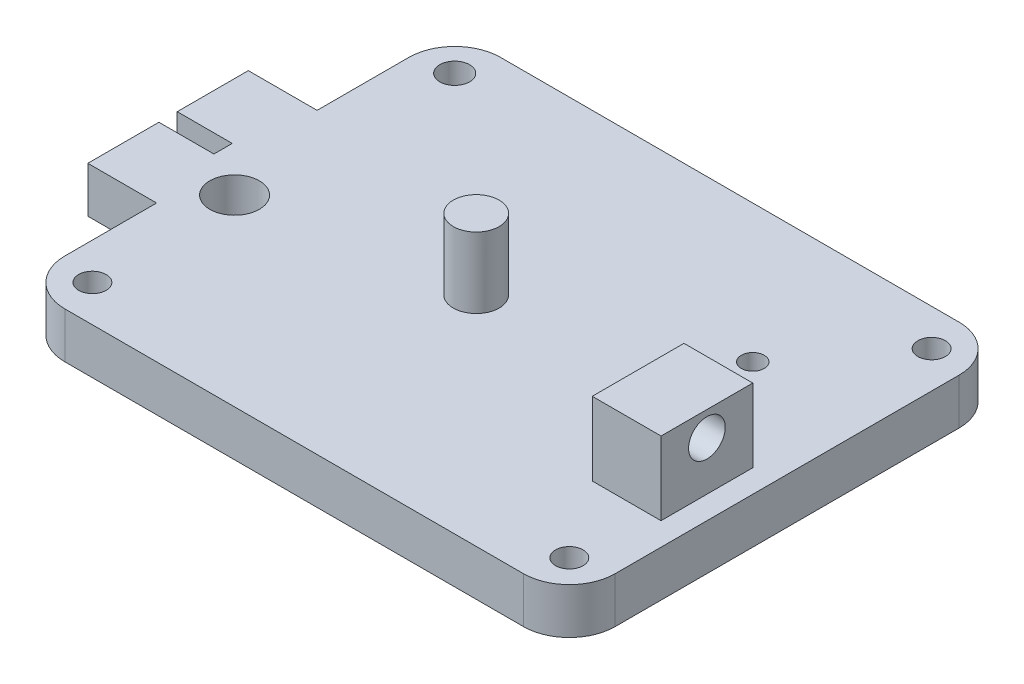
ISO-10303-21;
HEADER;
FILE_DESCRIPTION(('STEP AP214'),'2;1');
FILE_NAME('part.step','',(''),(''),'','','');
FILE_SCHEMA(('AUTOMOTIVE_DESIGN { 1 0 10303 214 1 1 1 1 }'));
ENDSEC;
DATA;
#1=APPLICATION_CONTEXT('core data for automotive mechanical design processes');
#2=APPLICATION_PROTOCOL_DEFINITION('international standard','automotive_design',2000,#1);
#3=PRODUCT_CONTEXT('',#1,'mechanical');
#4=PRODUCT('Part','Part','',(#3));
#5=PRODUCT_RELATED_PRODUCT_CATEGORY('part','',(#4));
#6=PRODUCT_DEFINITION_FORMATION('','',#4);
#7=PRODUCT_DEFINITION_CONTEXT('part definition',#1,'design');
#8=PRODUCT_DEFINITION('design','',#6,#7);
#9=PRODUCT_DEFINITION_SHAPE('','',#8);
#10=(LENGTH_UNIT() NAMED_UNIT(*) SI_UNIT(.MILLI.,.METRE.));
#11=(NAMED_UNIT(*) PLANE_ANGLE_UNIT() SI_UNIT($,.RADIAN.));
#12=(NAMED_UNIT(*) SI_UNIT($,.STERADIAN.) SOLID_ANGLE_UNIT());
#13=UNCERTAINTY_MEASURE_WITH_UNIT(LENGTH_MEASURE(1.E-05),#10,'distance_accuracy_value','');
#14=(GEOMETRIC_REPRESENTATION_CONTEXT(3) GLOBAL_UNCERTAINTY_ASSIGNED_CONTEXT((#13)) GLOBAL_UNIT_ASSIGNED_CONTEXT((#10,
#11,#12)) REPRESENTATION_CONTEXT('',''));
#15=CARTESIAN_POINT('',(0.,0.,0.));
#16=DIRECTION('',(0.,0.,1.));
#17=DIRECTION('',(1.,0.,0.));
#18=AXIS2_PLACEMENT_3D('',#15,#16,#17);
#19=CARTESIAN_POINT('',(-15.,0.,0.));
#20=DIRECTION('',(-1.,0.,0.));
#21=DIRECTION('',(0.,0.,1.));
#22=AXIS2_PLACEMENT_3D('',#19,#20,#21);
#23=PLANE('',#22);
#24=DIRECTION('',(0.,1.,0.));
#25=VECTOR('',#24,1.);
#26=CARTESIAN_POINT('',(-15.,0.,-45.5));
#27=LINE('',#26,#25);
#28=CARTESIAN_POINT('',(-15.,0.,-45.5));
#29=VERTEX_POINT('',#28);
#30=CARTESIAN_POINT('',(-15.,10.,-45.5));
#31=VERTEX_POINT('',#30);
#32=EDGE_CURVE('E222',#29,#31,#27,.T.);
#33=ORIENTED_EDGE('',*,*,#32,.F.);
#34=DIRECTION('',(0.,0.,1.));
#35=VECTOR('',#34,1.);
#36=CARTESIAN_POINT('',(-15.,0.,-65.));
#37=LINE('',#36,#35);
#38=CARTESIAN_POINT('',(-15.,0.,-30.));
#39=VERTEX_POINT('',#38);
#40=EDGE_CURVE('E231',#29,#39,#37,.T.);
#41=ORIENTED_EDGE('',*,*,#40,.T.);
#42=DIRECTION('',(0.,1.,0.));
#43=VECTOR('',#42,1.);
#44=CARTESIAN_POINT('',(-15.,10.,-30.));
#45=LINE('',#44,#43);
#46=CARTESIAN_POINT('',(-15.,10.,-30.));
#47=VERTEX_POINT('',#46);
#48=EDGE_CURVE('E236',#39,#47,#45,.T.);
#49=ORIENTED_EDGE('',*,*,#48,.T.);
#50=DIRECTION('',(0.,0.,-1.));
#51=VECTOR('',#50,1.);
#52=CARTESIAN_POINT('',(-15.,10.,-65.));
#53=LINE('',#52,#51);
#54=EDGE_CURVE('E240',#47,#31,#53,.T.);
#55=ORIENTED_EDGE('',*,*,#54,.T.);
#56=EDGE_LOOP('',(#33,#41,#49,#55));
#57=FACE_BOUND('',#56,.T.);
#58=ADVANCED_FACE('F41',(#57),#23,.T.);
#59=CARTESIAN_POINT('',(0.,10.,0.));
#60=DIRECTION('',(1.,0.,0.));
#61=DIRECTION('',(0.,0.,-1.));
#62=AXIS2_PLACEMENT_3D('',#59,#60,#61);
#63=PLANE('',#62);
#64=DIRECTION('',(0.,-1.,0.));
#65=VECTOR('',#64,1.);
#66=CARTESIAN_POINT('',(0.,10.,-65.));
#67=LINE('',#66,#65);
#68=CARTESIAN_POINT('',(0.,10.,-65.));
#69=VERTEX_POINT('',#68);
#70=CARTESIAN_POINT('',(0.,0.,-65.));
#71=VERTEX_POINT('',#70);
#72=EDGE_CURVE('E221',#69,#71,#67,.T.);
#73=ORIENTED_EDGE('',*,*,#72,.F.);
#74=DIRECTION('',(0.,0.,1.));
#75=VECTOR('',#74,1.);
#76=CARTESIAN_POINT('',(0.,10.,0.));
#77=LINE('',#76,#75);
#78=CARTESIAN_POINT('',(0.,10.,-85.));
#79=VERTEX_POINT('',#78);
#80=EDGE_CURVE('E315',#79,#69,#77,.T.);
#81=ORIENTED_EDGE('',*,*,#80,.F.);
#82=DIRECTION('',(0.,-1.,0.));
#83=VECTOR('',#82,1.);
#84=CARTESIAN_POINT('',(0.,10.,-85.));
#85=LINE('',#84,#83);
#86=CARTESIAN_POINT('',(0.,0.,-85.));
#87=VERTEX_POINT('',#86);
#88=EDGE_CURVE('E366',#79,#87,#85,.T.);
#89=ORIENTED_EDGE('',*,*,#88,.T.);
#90=DIRECTION('',(0.,0.,1.));
#91=VECTOR('',#90,1.);
#92=CARTESIAN_POINT('',(0.,0.,0.));
#93=LINE('',#92,#91);
#94=EDGE_CURVE('E332',#87,#71,#93,.T.);
#95=ORIENTED_EDGE('',*,*,#94,.T.);
#96=EDGE_LOOP('',(#73,#81,#89,#95));
#97=FACE_BOUND('',#96,.T.);
#98=ADVANCED_FACE('F422',(#97),#63,.F.);
#99=DIRECTION('',(0.,1.,0.));
#100=VECTOR('',#99,1.);
#101=CARTESIAN_POINT('',(0.,10.,-30.));
#102=LINE('',#101,#100);
#103=CARTESIAN_POINT('',(0.,0.,-30.));
#104=VERTEX_POINT('',#103);
#105=CARTESIAN_POINT('',(0.,10.,-30.));
#106=VERTEX_POINT('',#105);
#107=EDGE_CURVE('E232',#104,#106,#102,.T.);
#108=ORIENTED_EDGE('',*,*,#107,.F.);
#109=CARTESIAN_POINT('',(0.,0.,-10.));
#110=VERTEX_POINT('',#109);
#111=EDGE_CURVE('E314',#104,#110,#93,.T.);
#112=ORIENTED_EDGE('',*,*,#111,.T.);
#113=DIRECTION('',(0.,-1.,0.));
#114=VECTOR('',#113,1.);
#115=CARTESIAN_POINT('',(0.,10.,-10.));
#116=LINE('',#115,#114);
#117=CARTESIAN_POINT('',(0.,10.,-10.));
#118=VERTEX_POINT('',#117);
#119=EDGE_CURVE('E370',#110,#118,#116,.F.);
#120=ORIENTED_EDGE('',*,*,#119,.T.);
#121=EDGE_CURVE('E65',#106,#118,#77,.T.);
#122=ORIENTED_EDGE('',*,*,#121,.F.);
#123=EDGE_LOOP('',(#108,#112,#120,#122));
#124=FACE_BOUND('',#123,.T.);
#125=ADVANCED_FACE('F459',(#124),#63,.F.);
#126=CARTESIAN_POINT('',(0.,10.,0.));
#127=DIRECTION('',(0.,-1.,0.));
#128=DIRECTION('',(0.,0.,-1.));
#129=AXIS2_PLACEMENT_3D('',#126,#127,#128);
#130=PLANE('',#129);
#131=CARTESIAN_POINT('',(112.,10.,-8.));
#132=DIRECTION('',(0.,1.,0.));
#133=DIRECTION('',(0.,0.,1.));
#134=AXIS2_PLACEMENT_3D('',#131,#132,#133);
#135=CIRCLE('',#134,2.99999999999999);
#136=CARTESIAN_POINT('',(112.,10.,-5.00000000000001));
#137=VERTEX_POINT('',#136);
#138=EDGE_CURVE('E772',#137,#137,#135,.T.);
#139=ORIENTED_EDGE('',*,*,#138,.F.);
#140=EDGE_LOOP('',(#139));
#141=FACE_BOUND('',#140,.T.);
#142=CARTESIAN_POINT('',(7.99999999999999,10.,-8.));
#143=DIRECTION('',(0.,1.,0.));
#144=DIRECTION('',(0.,0.,1.));
#145=AXIS2_PLACEMENT_3D('',#142,#143,#144);
#146=CIRCLE('',#145,2.99999999999999);
#147=CARTESIAN_POINT('',(7.99999999999999,10.,-5.00000000000001));
#148=VERTEX_POINT('',#147);
#149=EDGE_CURVE('E804',#148,#148,#146,.T.);
#150=ORIENTED_EDGE('',*,*,#149,.F.);
#151=EDGE_LOOP('',(#150));
#152=FACE_BOUND('',#151,.T.);
#153=CARTESIAN_POINT('',(7.99999999999999,10.,-87.));
#154=DIRECTION('',(0.,1.,0.));
#155=DIRECTION('',(0.,0.,1.));
#156=AXIS2_PLACEMENT_3D('',#153,#154,#155);
#157=CIRCLE('',#156,3.25);
#158=CARTESIAN_POINT('',(7.99999999999999,10.,-83.75));
#159=VERTEX_POINT('',#158);
#160=EDGE_CURVE('E796',#159,#159,#157,.T.);
#161=ORIENTED_EDGE('',*,*,#160,.F.);
#162=EDGE_LOOP('',(#161));
#163=FACE_BOUND('',#162,.T.);
#164=CARTESIAN_POINT('',(112.,10.,-87.));
#165=DIRECTION('',(0.,1.,0.));
#166=DIRECTION('',(0.,0.,1.));
#167=AXIS2_PLACEMENT_3D('',#164,#165,#166);
#168=CIRCLE('',#167,2.99999999999999);
#169=CARTESIAN_POINT('',(112.,10.,-84.));
#170=VERTEX_POINT('',#169);
#171=EDGE_CURVE('E795',#170,#170,#168,.T.);
#172=ORIENTED_EDGE('',*,*,#171,.F.);
#173=EDGE_LOOP('',(#172));
#174=FACE_BOUND('',#173,.T.);
#175=CARTESIAN_POINT('',(95.,10.,-65.));
#176=DIRECTION('',(0.,1.,0.));
#177=DIRECTION('',(0.,0.,1.));
#178=AXIS2_PLACEMENT_3D('',#175,#176,#177);
#179=CIRCLE('',#178,2.5);
#180=CARTESIAN_POINT('',(95.,10.,-62.5));
#181=VERTEX_POINT('',#180);
#182=EDGE_CURVE('E826',#181,#181,#179,.T.);
#183=ORIENTED_EDGE('',*,*,#182,.F.);
#184=EDGE_LOOP('',(#183));
#185=FACE_BOUND('',#184,.T.);
#186=CARTESIAN_POINT('',(7.,10.,-40.));
#187=DIRECTION('',(0.,1.,0.));
#188=DIRECTION('',(0.,0.,1.));
#189=AXIS2_PLACEMENT_3D('',#186,#187,#188);
#190=CIRCLE('',#189,5.4);
#191=CARTESIAN_POINT('',(7.,10.,-34.6));
#192=VERTEX_POINT('',#191);
#193=EDGE_CURVE('E208',#192,#192,#190,.T.);
#194=ORIENTED_EDGE('',*,*,#193,.F.);
#195=EDGE_LOOP('',(#194));
#196=FACE_BOUND('',#195,.T.);
#197=DIRECTION('',(0.,0.,-1.));
#198=VECTOR('',#197,1.);
#199=CARTESIAN_POINT('',(-3.,10.,-49.5));
#200=LINE('',#199,#198);
#201=CARTESIAN_POINT('',(-3.,10.,-45.5));
#202=VERTEX_POINT('',#201);
#203=CARTESIAN_POINT('',(-3.,10.,-49.5));
#204=VERTEX_POINT('',#203);
#205=EDGE_CURVE('E187',#202,#204,#200,.T.);
#206=ORIENTED_EDGE('',*,*,#205,.F.);
#207=DIRECTION('',(1.,0.,0.));
#208=VECTOR('',#207,1.);
#209=CARTESIAN_POINT('',(-15.,10.,-45.5));
#210=LINE('',#209,#208);
#211=EDGE_CURVE('E202',#31,#202,#210,.T.);
#212=ORIENTED_EDGE('',*,*,#211,.F.);
#213=ORIENTED_EDGE('',*,*,#54,.F.);
#214=DIRECTION('',(1.,0.,0.));
#215=VECTOR('',#214,1.);
#216=CARTESIAN_POINT('',(-15.,10.,-30.));
#217=LINE('',#216,#215);
#218=EDGE_CURVE('E253',#47,#106,#217,.T.);
#219=ORIENTED_EDGE('',*,*,#218,.T.);
#220=ORIENTED_EDGE('',*,*,#121,.T.);
#221=CARTESIAN_POINT('',(10.,10.,-10.));
#222=DIRECTION('',(0.,-1.,0.));
#223=DIRECTION('',(0.,0.,-1.));
#224=AXIS2_PLACEMENT_3D('',#221,#222,#223);
#225=CIRCLE('',#224,10.);
#226=CARTESIAN_POINT('',(10.,10.,0.));
#227=VERTEX_POINT('',#226);
#228=EDGE_CURVE('E382',#118,#227,#225,.F.);
#229=ORIENTED_EDGE('',*,*,#228,.T.);
#230=DIRECTION('',(1.,0.,0.));
#231=VECTOR('',#230,1.);
#232=CARTESIAN_POINT('',(0.,10.,0.));
#233=LINE('',#232,#231);
#234=CARTESIAN_POINT('',(110.,10.,0.));
#235=VERTEX_POINT('',#234);
#236=EDGE_CURVE('E319',#227,#235,#233,.T.);
#237=ORIENTED_EDGE('',*,*,#236,.T.);
#238=CARTESIAN_POINT('',(110.,10.,-10.));
#239=DIRECTION('',(0.,-1.,0.));
#240=DIRECTION('',(0.,0.,-1.));
#241=AXIS2_PLACEMENT_3D('',#238,#239,#240);
#242=CIRCLE('',#241,10.);
#243=CARTESIAN_POINT('',(120.,10.,-10.));
#244=VERTEX_POINT('',#243);
#245=EDGE_CURVE('E373',#235,#244,#242,.F.);
#246=ORIENTED_EDGE('',*,*,#245,.T.);
#247=DIRECTION('',(0.,0.,-1.));
#248=VECTOR('',#247,1.);
#249=CARTESIAN_POINT('',(120.,10.,0.));
#250=LINE('',#249,#248);
#251=CARTESIAN_POINT('',(120.,10.,-85.));
#252=VERTEX_POINT('',#251);
#253=EDGE_CURVE('E323',#244,#252,#250,.T.);
#254=ORIENTED_EDGE('',*,*,#253,.T.);
#255=CARTESIAN_POINT('',(110.,10.,-85.));
#256=DIRECTION('',(0.,-1.,0.));
#257=DIRECTION('',(0.,0.,-1.));
#258=AXIS2_PLACEMENT_3D('',#255,#256,#257);
#259=CIRCLE('',#258,10.);
#260=CARTESIAN_POINT('',(110.,10.,-95.));
#261=VERTEX_POINT('',#260);
#262=EDGE_CURVE('E376',#252,#261,#259,.F.);
#263=ORIENTED_EDGE('',*,*,#262,.T.);
#264=DIRECTION('',(-1.,0.,0.));
#265=VECTOR('',#264,1.);
#266=CARTESIAN_POINT('',(0.,10.,-95.));
#267=LINE('',#266,#265);
#268=CARTESIAN_POINT('',(10.,10.,-95.));
#269=VERTEX_POINT('',#268);
#270=EDGE_CURVE('E327',#261,#269,#267,.T.);
#271=ORIENTED_EDGE('',*,*,#270,.T.);
#272=CARTESIAN_POINT('',(10.,10.,-85.));
#273=DIRECTION('',(0.,-1.,0.));
#274=DIRECTION('',(0.,0.,-1.));
#275=AXIS2_PLACEMENT_3D('',#272,#273,#274);
#276=CIRCLE('',#275,10.);
#277=EDGE_CURVE('E379',#269,#79,#276,.F.);
#278=ORIENTED_EDGE('',*,*,#277,.T.);
#279=ORIENTED_EDGE('',*,*,#80,.T.);
#280=DIRECTION('',(1.,0.,0.));
#281=VECTOR('',#280,1.);
#282=CARTESIAN_POINT('',(-15.,10.,-65.));
#283=LINE('',#282,#281);
#284=CARTESIAN_POINT('',(-15.,10.,-65.));
#285=VERTEX_POINT('',#284);
#286=EDGE_CURVE('E244',#285,#69,#283,.T.);
#287=ORIENTED_EDGE('',*,*,#286,.F.);
#288=CARTESIAN_POINT('',(-15.,10.,-49.5));
#289=VERTEX_POINT('',#288);
#290=EDGE_CURVE('E239',#289,#285,#53,.T.);
#291=ORIENTED_EDGE('',*,*,#290,.F.);
#292=DIRECTION('',(-1.,0.,0.));
#293=VECTOR('',#292,1.);
#294=CARTESIAN_POINT('',(-15.,10.,-49.5));
#295=LINE('',#294,#293);
#296=EDGE_CURVE('E57',#204,#289,#295,.T.);
#297=ORIENTED_EDGE('',*,*,#296,.F.);
#298=EDGE_LOOP('',(#206,#212,#213,#219,#220,#229,#237,#246,#254,#263,#271,#278,#279,#287,#291,#297));
#299=FACE_BOUND('',#298,.T.);
#300=CARTESIAN_POINT('',(52.2,10.,-47.5));
#301=DIRECTION('',(0.,-1.,0.));
#302=DIRECTION('',(0.,0.,-1.));
#303=AXIS2_PLACEMENT_3D('',#300,#301,#302);
#304=CIRCLE('',#303,5.);
#305=CARTESIAN_POINT('',(52.2,10.,-52.5));
#306=VERTEX_POINT('',#305);
#307=EDGE_CURVE('E11',#306,#306,#304,.F.);
#308=ORIENTED_EDGE('',*,*,#307,.F.);
#309=EDGE_LOOP('',(#308));
#310=FACE_BOUND('',#309,.T.);
#311=DIRECTION('',(0.,0.,1.));
#312=VECTOR('',#311,1.);
#313=CARTESIAN_POINT('',(100.,10.,-25.));
#314=LINE('',#313,#312);
#315=CARTESIAN_POINT('',(100.,10.,-45.));
#316=VERTEX_POINT('',#315);
#317=CARTESIAN_POINT('',(100.,10.,-25.));
#318=VERTEX_POINT('',#317);
#319=EDGE_CURVE('E265',#316,#318,#314,.T.);
#320=ORIENTED_EDGE('',*,*,#319,.F.);
#321=DIRECTION('',(-1.,0.,0.));
#322=VECTOR('',#321,1.);
#323=CARTESIAN_POINT('',(100.,10.,-45.));
#324=LINE('',#323,#322);
#325=CARTESIAN_POINT('',(115.,10.,-45.));
#326=VERTEX_POINT('',#325);
#327=EDGE_CURVE('E271',#326,#316,#324,.T.);
#328=ORIENTED_EDGE('',*,*,#327,.F.);
#329=DIRECTION('',(0.,0.,-1.));
#330=VECTOR('',#329,1.);
#331=CARTESIAN_POINT('',(115.,10.,-25.));
#332=LINE('',#331,#330);
#333=CARTESIAN_POINT('',(115.,10.,-25.));
#334=VERTEX_POINT('',#333);
#335=EDGE_CURVE('E288',#334,#326,#332,.T.);
#336=ORIENTED_EDGE('',*,*,#335,.F.);
#337=DIRECTION('',(1.,0.,0.));
#338=VECTOR('',#337,1.);
#339=CARTESIAN_POINT('',(100.,10.,-25.));
#340=LINE('',#339,#338);
#341=EDGE_CURVE('E284',#318,#334,#340,.T.);
#342=ORIENTED_EDGE('',*,*,#341,.F.);
#343=EDGE_LOOP('',(#320,#328,#336,#342));
#344=FACE_BOUND('',#343,.T.);
#345=ADVANCED_FACE('F405',(#141,#152,#163,#174,#185,#196,#299,#310,#344),#130,.F.);
#346=CARTESIAN_POINT('',(0.,10.,0.));
#347=DIRECTION('',(0.,0.,-1.));
#348=DIRECTION('',(-1.,0.,0.));
#349=AXIS2_PLACEMENT_3D('',#346,#347,#348);
#350=PLANE('',#349);
#351=ORIENTED_EDGE('',*,*,#236,.F.);
#352=DIRECTION('',(0.,-1.,0.));
#353=VECTOR('',#352,1.);
#354=CARTESIAN_POINT('',(10.,10.,0.));
#355=LINE('',#354,#353);
#356=CARTESIAN_POINT('',(10.,0.,0.));
#357=VERTEX_POINT('',#356);
#358=EDGE_CURVE('E349',#227,#357,#355,.T.);
#359=ORIENTED_EDGE('',*,*,#358,.T.);
#360=DIRECTION('',(1.,0.,0.));
#361=VECTOR('',#360,1.);
#362=CARTESIAN_POINT('',(0.,0.,0.));
#363=LINE('',#362,#361);
#364=CARTESIAN_POINT('',(110.,0.,0.));
#365=VERTEX_POINT('',#364);
#366=EDGE_CURVE('E335',#357,#365,#363,.T.);
#367=ORIENTED_EDGE('',*,*,#366,.T.);
#368=DIRECTION('',(0.,-1.,0.));
#369=VECTOR('',#368,1.);
#370=CARTESIAN_POINT('',(110.,10.,0.));
#371=LINE('',#370,#369);
#372=EDGE_CURVE('E331',#365,#235,#371,.F.);
#373=ORIENTED_EDGE('',*,*,#372,.T.);
#374=EDGE_LOOP('',(#351,#359,#367,#373));
#375=FACE_BOUND('',#374,.T.);
#376=ADVANCED_FACE('F501',(#375),#350,.F.);
#377=CARTESIAN_POINT('',(120.,10.,0.));
#378=DIRECTION('',(-1.,0.,0.));
#379=DIRECTION('',(0.,0.,1.));
#380=AXIS2_PLACEMENT_3D('',#377,#378,#379);
#381=PLANE('',#380);
#382=DIRECTION('',(0.,0.,-1.));
#383=VECTOR('',#382,1.);
#384=CARTESIAN_POINT('',(120.,0.,0.));
#385=LINE('',#384,#383);
#386=CARTESIAN_POINT('',(120.,0.,-10.));
#387=VERTEX_POINT('',#386);
#388=CARTESIAN_POINT('',(120.,0.,-85.));
#389=VERTEX_POINT('',#388);
#390=EDGE_CURVE('E339',#387,#389,#385,.T.);
#391=ORIENTED_EDGE('',*,*,#390,.T.);
#392=DIRECTION('',(0.,-1.,0.));
#393=VECTOR('',#392,1.);
#394=CARTESIAN_POINT('',(120.,10.,-85.));
#395=LINE('',#394,#393);
#396=EDGE_CURVE('E50',#389,#252,#395,.F.);
#397=ORIENTED_EDGE('',*,*,#396,.T.);
#398=ORIENTED_EDGE('',*,*,#253,.F.);
#399=DIRECTION('',(0.,-1.,0.));
#400=VECTOR('',#399,1.);
#401=CARTESIAN_POINT('',(120.,10.,-10.));
#402=LINE('',#401,#400);
#403=EDGE_CURVE('E392',#244,#387,#402,.T.);
#404=ORIENTED_EDGE('',*,*,#403,.T.);
#405=EDGE_LOOP('',(#391,#397,#398,#404));
#406=FACE_BOUND('',#405,.T.);
#407=ADVANCED_FACE('F399',(#406),#381,.F.);
#408=CARTESIAN_POINT('',(0.,10.,-95.));
#409=DIRECTION('',(0.,0.,1.));
#410=DIRECTION('',(1.,0.,0.));
#411=AXIS2_PLACEMENT_3D('',#408,#409,#410);
#412=PLANE('',#411);
#413=DIRECTION('',(-1.,0.,0.));
#414=VECTOR('',#413,1.);
#415=CARTESIAN_POINT('',(0.,0.,-95.));
#416=LINE('',#415,#414);
#417=CARTESIAN_POINT('',(110.,0.,-95.));
#418=VERTEX_POINT('',#417);
#419=CARTESIAN_POINT('',(10.,0.,-95.));
#420=VERTEX_POINT('',#419);
#421=EDGE_CURVE('E343',#418,#420,#416,.T.);
#422=ORIENTED_EDGE('',*,*,#421,.T.);
#423=DIRECTION('',(0.,-1.,0.));
#424=VECTOR('',#423,1.);
#425=CARTESIAN_POINT('',(10.,10.,-95.));
#426=LINE('',#425,#424);
#427=EDGE_CURVE('E389',#420,#269,#426,.F.);
#428=ORIENTED_EDGE('',*,*,#427,.T.);
#429=ORIENTED_EDGE('',*,*,#270,.F.);
#430=DIRECTION('',(0.,-1.,0.));
#431=VECTOR('',#430,1.);
#432=CARTESIAN_POINT('',(110.,10.,-95.));
#433=LINE('',#432,#431);
#434=EDGE_CURVE('E385',#261,#418,#433,.T.);
#435=ORIENTED_EDGE('',*,*,#434,.T.);
#436=EDGE_LOOP('',(#422,#428,#429,#435));
#437=FACE_BOUND('',#436,.T.);
#438=ADVANCED_FACE('F413',(#437),#412,.F.);
#439=CARTESIAN_POINT('',(0.,0.,0.));
#440=DIRECTION('',(0.,-1.,0.));
#441=DIRECTION('',(0.,0.,-1.));
#442=AXIS2_PLACEMENT_3D('',#439,#440,#441);
#443=PLANE('',#442);
#444=CARTESIAN_POINT('',(54.4639937656131,0.,-37.5));
#445=DIRECTION('',(0.,-1.,0.));
#446=DIRECTION('',(0.,0.,-1.));
#447=AXIS2_PLACEMENT_3D('',#444,#445,#446);
#448=CIRCLE('',#447,2.5);
#449=CARTESIAN_POINT('',(54.4639937656131,0.,-40.));
#450=VERTEX_POINT('',#449);
#451=EDGE_CURVE('E773',#450,#450,#448,.T.);
#452=ORIENTED_EDGE('',*,*,#451,.F.);
#453=EDGE_LOOP('',(#452));
#454=FACE_BOUND('',#453,.T.);
#455=CARTESIAN_POINT('',(54.4639937656131,0.,-57.5));
#456=DIRECTION('',(0.,-1.,0.));
#457=DIRECTION('',(0.,0.,-1.));
#458=AXIS2_PLACEMENT_3D('',#455,#456,#457);
#459=CIRCLE('',#458,2.65);
#460=CARTESIAN_POINT('',(54.4639937656131,0.,-60.15));
#461=VERTEX_POINT('',#460);
#462=EDGE_CURVE('E787',#461,#461,#459,.T.);
#463=ORIENTED_EDGE('',*,*,#462,.F.);
#464=EDGE_LOOP('',(#463));
#465=FACE_BOUND('',#464,.T.);
#466=CARTESIAN_POINT('',(112.,0.,-8.));
#467=DIRECTION('',(0.,1.,0.));
#468=DIRECTION('',(0.,0.,1.));
#469=AXIS2_PLACEMENT_3D('',#466,#467,#468);
#470=CIRCLE('',#469,2.99999999999999);
#471=CARTESIAN_POINT('',(112.,0.,-5.00000000000001));
#472=VERTEX_POINT('',#471);
#473=EDGE_CURVE('E778',#472,#472,#470,.T.);
#474=ORIENTED_EDGE('',*,*,#473,.T.);
#475=EDGE_LOOP('',(#474));
#476=FACE_BOUND('',#475,.T.);
#477=CARTESIAN_POINT('',(7.99999999999999,0.,-8.));
#478=DIRECTION('',(0.,1.,0.));
#479=DIRECTION('',(0.,0.,1.));
#480=AXIS2_PLACEMENT_3D('',#477,#478,#479);
#481=CIRCLE('',#480,2.99999999999999);
#482=CARTESIAN_POINT('',(7.99999999999999,0.,-5.00000000000001));
#483=VERTEX_POINT('',#482);
#484=EDGE_CURVE('E800',#483,#483,#481,.T.);
#485=ORIENTED_EDGE('',*,*,#484,.T.);
#486=EDGE_LOOP('',(#485));
#487=FACE_BOUND('',#486,.T.);
#488=CARTESIAN_POINT('',(7.99999999999999,0.,-87.));
#489=DIRECTION('',(0.,1.,0.));
#490=DIRECTION('',(0.,0.,1.));
#491=AXIS2_PLACEMENT_3D('',#488,#489,#490);
#492=CIRCLE('',#491,3.25);
#493=CARTESIAN_POINT('',(7.99999999999999,0.,-83.75));
#494=VERTEX_POINT('',#493);
#495=EDGE_CURVE('E791',#494,#494,#492,.T.);
#496=ORIENTED_EDGE('',*,*,#495,.T.);
#497=EDGE_LOOP('',(#496));
#498=FACE_BOUND('',#497,.T.);
#499=CARTESIAN_POINT('',(112.,0.,-87.));
#500=DIRECTION('',(0.,1.,0.));
#501=DIRECTION('',(0.,0.,1.));
#502=AXIS2_PLACEMENT_3D('',#499,#500,#501);
#503=CIRCLE('',#502,2.99999999999999);
#504=CARTESIAN_POINT('',(112.,0.,-84.));
#505=VERTEX_POINT('',#504);
#506=EDGE_CURVE('E811',#505,#505,#503,.T.);
#507=ORIENTED_EDGE('',*,*,#506,.T.);
#508=EDGE_LOOP('',(#507));
#509=FACE_BOUND('',#508,.T.);
#510=CARTESIAN_POINT('',(95.,0.,-65.));
#511=DIRECTION('',(0.,1.,0.));
#512=DIRECTION('',(0.,0.,1.));
#513=AXIS2_PLACEMENT_3D('',#510,#511,#512);
#514=CIRCLE('',#513,2.5);
#515=CARTESIAN_POINT('',(95.,0.,-62.5));
#516=VERTEX_POINT('',#515);
#517=EDGE_CURVE('E827',#516,#516,#514,.T.);
#518=ORIENTED_EDGE('',*,*,#517,.T.);
#519=EDGE_LOOP('',(#518));
#520=FACE_BOUND('',#519,.T.);
#521=CARTESIAN_POINT('',(7.,0.,-40.));
#522=DIRECTION('',(0.,1.,0.));
#523=DIRECTION('',(0.,0.,1.));
#524=AXIS2_PLACEMENT_3D('',#521,#522,#523);
#525=CIRCLE('',#524,5.4);
#526=CARTESIAN_POINT('',(7.,0.,-34.6));
#527=VERTEX_POINT('',#526);
#528=EDGE_CURVE('E215',#527,#527,#525,.T.);
#529=ORIENTED_EDGE('',*,*,#528,.T.);
#530=EDGE_LOOP('',(#529));
#531=FACE_BOUND('',#530,.T.);
#532=DIRECTION('',(1.,0.,0.));
#533=VECTOR('',#532,1.);
#534=CARTESIAN_POINT('',(-15.,0.,-45.5));
#535=LINE('',#534,#533);
#536=CARTESIAN_POINT('',(-3.,0.,-45.5));
#537=VERTEX_POINT('',#536);
#538=EDGE_CURVE('E190',#29,#537,#535,.T.);
#539=ORIENTED_EDGE('',*,*,#538,.T.);
#540=DIRECTION('',(0.,0.,-1.));
#541=VECTOR('',#540,1.);
#542=CARTESIAN_POINT('',(-3.,0.,-49.5));
#543=LINE('',#542,#541);
#544=CARTESIAN_POINT('',(-3.,0.,-49.5));
#545=VERTEX_POINT('',#544);
#546=EDGE_CURVE('E184',#537,#545,#543,.T.);
#547=ORIENTED_EDGE('',*,*,#546,.T.);
#548=DIRECTION('',(-1.,0.,0.));
#549=VECTOR('',#548,1.);
#550=CARTESIAN_POINT('',(-15.,0.,-49.5));
#551=LINE('',#550,#549);
#552=CARTESIAN_POINT('',(-15.,0.,-49.5));
#553=VERTEX_POINT('',#552);
#554=EDGE_CURVE('E193',#545,#553,#551,.T.);
#555=ORIENTED_EDGE('',*,*,#554,.T.);
#556=CARTESIAN_POINT('',(-15.,0.,-65.));
#557=VERTEX_POINT('',#556);
#558=EDGE_CURVE('E233',#557,#553,#37,.T.);
#559=ORIENTED_EDGE('',*,*,#558,.F.);
#560=DIRECTION('',(1.,0.,0.));
#561=VECTOR('',#560,1.);
#562=CARTESIAN_POINT('',(-15.,0.,-65.));
#563=LINE('',#562,#561);
#564=EDGE_CURVE('E261',#557,#71,#563,.T.);
#565=ORIENTED_EDGE('',*,*,#564,.T.);
#566=ORIENTED_EDGE('',*,*,#94,.F.);
#567=CARTESIAN_POINT('',(10.,0.,-85.));
#568=DIRECTION('',(0.,-1.,0.));
#569=DIRECTION('',(0.,0.,-1.));
#570=AXIS2_PLACEMENT_3D('',#567,#568,#569);
#571=CIRCLE('',#570,10.);
#572=EDGE_CURVE('E359',#87,#420,#571,.T.);
#573=ORIENTED_EDGE('',*,*,#572,.T.);
#574=ORIENTED_EDGE('',*,*,#421,.F.);
#575=CARTESIAN_POINT('',(110.,0.,-85.));
#576=DIRECTION('',(0.,-1.,0.));
#577=DIRECTION('',(0.,0.,-1.));
#578=AXIS2_PLACEMENT_3D('',#575,#576,#577);
#579=CIRCLE('',#578,10.);
#580=EDGE_CURVE('E356',#418,#389,#579,.T.);
#581=ORIENTED_EDGE('',*,*,#580,.T.);
#582=ORIENTED_EDGE('',*,*,#390,.F.);
#583=CARTESIAN_POINT('',(110.,0.,-10.));
#584=DIRECTION('',(0.,-1.,0.));
#585=DIRECTION('',(0.,0.,-1.));
#586=AXIS2_PLACEMENT_3D('',#583,#584,#585);
#587=CIRCLE('',#586,10.);
#588=EDGE_CURVE('E353',#387,#365,#587,.T.);
#589=ORIENTED_EDGE('',*,*,#588,.T.);
#590=ORIENTED_EDGE('',*,*,#366,.F.);
#591=CARTESIAN_POINT('',(10.,0.,-10.));
#592=DIRECTION('',(0.,-1.,0.));
#593=DIRECTION('',(0.,0.,-1.));
#594=AXIS2_PLACEMENT_3D('',#591,#592,#593);
#595=CIRCLE('',#594,10.);
#596=EDGE_CURVE('E362',#357,#110,#595,.T.);
#597=ORIENTED_EDGE('',*,*,#596,.T.);
#598=ORIENTED_EDGE('',*,*,#111,.F.);
#599=DIRECTION('',(1.,0.,0.));
#600=VECTOR('',#599,1.);
#601=CARTESIAN_POINT('',(-15.,0.,-30.));
#602=LINE('',#601,#600);
#603=EDGE_CURVE('E257',#39,#104,#602,.T.);
#604=ORIENTED_EDGE('',*,*,#603,.F.);
#605=ORIENTED_EDGE('',*,*,#40,.F.);
#606=EDGE_LOOP('',(#539,#547,#555,#559,#565,#566,#573,#574,#581,#582,#589,#590,#597,#598,#604,#605));
#607=FACE_BOUND('',#606,.T.);
#608=ADVANCED_FACE('F199',(#454,#465,#476,#487,#498,#509,#520,#531,#607),#443,.T.);
#609=CARTESIAN_POINT('',(10.,10.,-10.));
#610=DIRECTION('',(0.,-1.,0.));
#611=DIRECTION('',(0.,0.,-1.));
#612=AXIS2_PLACEMENT_3D('',#609,#610,#611);
#613=CYLINDRICAL_SURFACE('',#612,10.);
#614=ORIENTED_EDGE('',*,*,#228,.F.);
#615=ORIENTED_EDGE('',*,*,#119,.F.);
#616=ORIENTED_EDGE('',*,*,#596,.F.);
#617=ORIENTED_EDGE('',*,*,#358,.F.);
#618=EDGE_LOOP('',(#614,#615,#616,#617));
#619=FACE_BOUND('',#618,.T.);
#620=ADVANCED_FACE('F505',(#619),#613,.T.);
#621=CARTESIAN_POINT('',(10.,10.,-85.));
#622=DIRECTION('',(0.,-1.,0.));
#623=DIRECTION('',(0.,0.,-1.));
#624=AXIS2_PLACEMENT_3D('',#621,#622,#623);
#625=CYLINDRICAL_SURFACE('',#624,10.);
#626=ORIENTED_EDGE('',*,*,#277,.F.);
#627=ORIENTED_EDGE('',*,*,#427,.F.);
#628=ORIENTED_EDGE('',*,*,#572,.F.);
#629=ORIENTED_EDGE('',*,*,#88,.F.);
#630=EDGE_LOOP('',(#626,#627,#628,#629));
#631=FACE_BOUND('',#630,.T.);
#632=ADVANCED_FACE('F419',(#631),#625,.T.);
#633=CARTESIAN_POINT('',(110.,10.,-85.));
#634=DIRECTION('',(0.,-1.,0.));
#635=DIRECTION('',(0.,0.,-1.));
#636=AXIS2_PLACEMENT_3D('',#633,#634,#635);
#637=CYLINDRICAL_SURFACE('',#636,10.);
#638=ORIENTED_EDGE('',*,*,#262,.F.);
#639=ORIENTED_EDGE('',*,*,#396,.F.);
#640=ORIENTED_EDGE('',*,*,#580,.F.);
#641=ORIENTED_EDGE('',*,*,#434,.F.);
#642=EDGE_LOOP('',(#638,#639,#640,#641));
#643=FACE_BOUND('',#642,.T.);
#644=ADVANCED_FACE('F410',(#643),#637,.T.);
#645=CARTESIAN_POINT('',(110.,10.,-10.));
#646=DIRECTION('',(0.,-1.,0.));
#647=DIRECTION('',(0.,0.,-1.));
#648=AXIS2_PLACEMENT_3D('',#645,#646,#647);
#649=CYLINDRICAL_SURFACE('',#648,10.);
#650=ORIENTED_EDGE('',*,*,#245,.F.);
#651=ORIENTED_EDGE('',*,*,#372,.F.);
#652=ORIENTED_EDGE('',*,*,#588,.F.);
#653=ORIENTED_EDGE('',*,*,#403,.F.);
#654=EDGE_LOOP('',(#650,#651,#652,#653));
#655=FACE_BOUND('',#654,.T.);
#656=ADVANCED_FACE('F43',(#655),#649,.T.);
#657=CARTESIAN_POINT('',(52.2,25.4,-47.5));
#658=DIRECTION('',(0.,-1.,0.));
#659=DIRECTION('',(0.,0.,-1.));
#660=AXIS2_PLACEMENT_3D('',#657,#658,#659);
#661=CYLINDRICAL_SURFACE('',#660,5.);
#662=CARTESIAN_POINT('',(52.2,25.4,-47.5));
#663=DIRECTION('',(0.,1.,0.));
#664=DIRECTION('',(0.,0.,1.));
#665=AXIS2_PLACEMENT_3D('',#662,#663,#664);
#666=CIRCLE('',#665,5.);
#667=CARTESIAN_POINT('',(52.2,25.4,-42.5));
#668=VERTEX_POINT('',#667);
#669=EDGE_CURVE('E310',#668,#668,#666,.T.);
#670=ORIENTED_EDGE('',*,*,#669,.F.);
#671=EDGE_LOOP('',(#670));
#672=FACE_BOUND('',#671,.T.);
#673=ORIENTED_EDGE('',*,*,#307,.T.);
#674=EDGE_LOOP('',(#673));
#675=FACE_BOUND('',#674,.T.);
#676=ADVANCED_FACE('F494',(#672,#675),#661,.T.);
#677=CARTESIAN_POINT('',(52.2,25.4,-47.5));
#678=DIRECTION('',(0.,1.,0.));
#679=DIRECTION('',(0.,0.,1.));
#680=AXIS2_PLACEMENT_3D('',#677,#678,#679);
#681=PLANE('',#680);
#682=ORIENTED_EDGE('',*,*,#669,.T.);
#683=EDGE_LOOP('',(#682));
#684=FACE_BOUND('',#683,.T.);
#685=ADVANCED_FACE('F490',(#684),#681,.T.);
#686=CARTESIAN_POINT('',(100.,26.,-25.));
#687=DIRECTION('',(1.,0.,0.));
#688=DIRECTION('',(0.,0.,-1.));
#689=AXIS2_PLACEMENT_3D('',#686,#687,#688);
#690=PLANE('',#689);
#691=CARTESIAN_POINT('',(100.,20.6546783521588,-35.0006933918081));
#692=DIRECTION('',(1.,0.,0.));
#693=DIRECTION('',(0.,0.,-1.));
#694=AXIS2_PLACEMENT_3D('',#691,#692,#693);
#695=CIRCLE('',#694,4.00000000000001);
#696=CARTESIAN_POINT('',(100.,20.6546783521588,-39.0006933918081));
#697=VERTEX_POINT('',#696);
#698=EDGE_CURVE('E822',#697,#697,#695,.F.);
#699=ORIENTED_EDGE('',*,*,#698,.F.);
#700=EDGE_LOOP('',(#699));
#701=FACE_BOUND('',#700,.T.);
#702=ORIENTED_EDGE('',*,*,#319,.T.);
#703=DIRECTION('',(0.,-1.,0.));
#704=VECTOR('',#703,1.);
#705=CARTESIAN_POINT('',(100.,26.,-25.));
#706=LINE('',#705,#704);
#707=CARTESIAN_POINT('',(100.,26.,-25.));
#708=VERTEX_POINT('',#707);
#709=EDGE_CURVE('E306',#708,#318,#706,.T.);
#710=ORIENTED_EDGE('',*,*,#709,.F.);
#711=DIRECTION('',(0.,0.,1.));
#712=VECTOR('',#711,1.);
#713=CARTESIAN_POINT('',(100.,26.,-25.));
#714=LINE('',#713,#712);
#715=CARTESIAN_POINT('',(100.,26.,-45.));
#716=VERTEX_POINT('',#715);
#717=EDGE_CURVE('E266',#716,#708,#714,.T.);
#718=ORIENTED_EDGE('',*,*,#717,.F.);
#719=DIRECTION('',(0.,-1.,0.));
#720=VECTOR('',#719,1.);
#721=CARTESIAN_POINT('',(100.,26.,-45.));
#722=LINE('',#721,#720);
#723=EDGE_CURVE('E280',#716,#316,#722,.T.);
#724=ORIENTED_EDGE('',*,*,#723,.T.);
#725=EDGE_LOOP('',(#702,#710,#718,#724));
#726=FACE_BOUND('',#725,.T.);
#727=ADVANCED_FACE('F486',(#701,#726),#690,.F.);
#728=CARTESIAN_POINT('',(100.,26.,-25.));
#729=DIRECTION('',(0.,0.,-1.));
#730=DIRECTION('',(-1.,0.,0.));
#731=AXIS2_PLACEMENT_3D('',#728,#729,#730);
#732=PLANE('',#731);
#733=ORIENTED_EDGE('',*,*,#341,.T.);
#734=DIRECTION('',(0.,-1.,0.));
#735=VECTOR('',#734,1.);
#736=CARTESIAN_POINT('',(115.,26.,-25.));
#737=LINE('',#736,#735);
#738=CARTESIAN_POINT('',(115.,26.,-25.));
#739=VERTEX_POINT('',#738);
#740=EDGE_CURVE('E302',#739,#334,#737,.T.);
#741=ORIENTED_EDGE('',*,*,#740,.F.);
#742=DIRECTION('',(1.,0.,0.));
#743=VECTOR('',#742,1.);
#744=CARTESIAN_POINT('',(100.,26.,-25.));
#745=LINE('',#744,#743);
#746=EDGE_CURVE('E270',#708,#739,#745,.T.);
#747=ORIENTED_EDGE('',*,*,#746,.F.);
#748=ORIENTED_EDGE('',*,*,#709,.T.);
#749=EDGE_LOOP('',(#733,#741,#747,#748));
#750=FACE_BOUND('',#749,.T.);
#751=ADVANCED_FACE('F482',(#750),#732,.F.);
#752=CARTESIAN_POINT('',(115.,26.,-25.));
#753=DIRECTION('',(-1.,0.,0.));
#754=DIRECTION('',(0.,0.,1.));
#755=AXIS2_PLACEMENT_3D('',#752,#753,#754);
#756=PLANE('',#755);
#757=CARTESIAN_POINT('',(115.,20.6546783521588,-35.0006933918081));
#758=DIRECTION('',(1.,0.,0.));
#759=DIRECTION('',(0.,0.,-1.));
#760=AXIS2_PLACEMENT_3D('',#757,#758,#759);
#761=CIRCLE('',#760,4.00000000000001);
#762=CARTESIAN_POINT('',(115.,20.6546783521588,-39.0006933918081));
#763=VERTEX_POINT('',#762);
#764=EDGE_CURVE('E815',#763,#763,#761,.T.);
#765=ORIENTED_EDGE('',*,*,#764,.F.);
#766=EDGE_LOOP('',(#765));
#767=FACE_BOUND('',#766,.T.);
#768=ORIENTED_EDGE('',*,*,#335,.T.);
#769=DIRECTION('',(0.,-1.,0.));
#770=VECTOR('',#769,1.);
#771=CARTESIAN_POINT('',(115.,26.,-45.));
#772=LINE('',#771,#770);
#773=CARTESIAN_POINT('',(115.,26.,-45.));
#774=VERTEX_POINT('',#773);
#775=EDGE_CURVE('E298',#774,#326,#772,.T.);
#776=ORIENTED_EDGE('',*,*,#775,.F.);
#777=DIRECTION('',(0.,0.,-1.));
#778=VECTOR('',#777,1.);
#779=CARTESIAN_POINT('',(115.,26.,-25.));
#780=LINE('',#779,#778);
#781=EDGE_CURVE('E274',#739,#774,#780,.T.);
#782=ORIENTED_EDGE('',*,*,#781,.F.);
#783=ORIENTED_EDGE('',*,*,#740,.T.);
#784=EDGE_LOOP('',(#768,#776,#782,#783));
#785=FACE_BOUND('',#784,.T.);
#786=ADVANCED_FACE('F478',(#767,#785),#756,.F.);
#787=CARTESIAN_POINT('',(100.,26.,-45.));
#788=DIRECTION('',(0.,0.,1.));
#789=DIRECTION('',(1.,0.,0.));
#790=AXIS2_PLACEMENT_3D('',#787,#788,#789);
#791=PLANE('',#790);
#792=ORIENTED_EDGE('',*,*,#327,.T.);
#793=ORIENTED_EDGE('',*,*,#723,.F.);
#794=DIRECTION('',(-1.,0.,0.));
#795=VECTOR('',#794,1.);
#796=CARTESIAN_POINT('',(100.,26.,-45.));
#797=LINE('',#796,#795);
#798=EDGE_CURVE('E277',#774,#716,#797,.T.);
#799=ORIENTED_EDGE('',*,*,#798,.F.);
#800=ORIENTED_EDGE('',*,*,#775,.T.);
#801=EDGE_LOOP('',(#792,#793,#799,#800));
#802=FACE_BOUND('',#801,.T.);
#803=ADVANCED_FACE('F474',(#802),#791,.F.);
#804=CARTESIAN_POINT('',(0.,26.,0.));
#805=DIRECTION('',(0.,-1.,0.));
#806=DIRECTION('',(0.,0.,-1.));
#807=AXIS2_PLACEMENT_3D('',#804,#805,#806);
#808=PLANE('',#807);
#809=ORIENTED_EDGE('',*,*,#717,.T.);
#810=ORIENTED_EDGE('',*,*,#746,.T.);
#811=ORIENTED_EDGE('',*,*,#781,.T.);
#812=ORIENTED_EDGE('',*,*,#798,.T.);
#813=EDGE_LOOP('',(#809,#810,#811,#812));
#814=FACE_BOUND('',#813,.T.);
#815=ADVANCED_FACE('F469',(#814),#808,.F.);
#816=CARTESIAN_POINT('',(-15.,10.,-65.));
#817=DIRECTION('',(0.,0.,1.));
#818=DIRECTION('',(1.,0.,0.));
#819=AXIS2_PLACEMENT_3D('',#816,#817,#818);
#820=PLANE('',#819);
#821=ORIENTED_EDGE('',*,*,#72,.T.);
#822=ORIENTED_EDGE('',*,*,#564,.F.);
#823=DIRECTION('',(0.,-1.,0.));
#824=VECTOR('',#823,1.);
#825=CARTESIAN_POINT('',(-15.,10.,-65.));
#826=LINE('',#825,#824);
#827=EDGE_CURVE('E227',#285,#557,#826,.T.);
#828=ORIENTED_EDGE('',*,*,#827,.F.);
#829=ORIENTED_EDGE('',*,*,#286,.T.);
#830=EDGE_LOOP('',(#821,#822,#828,#829));
#831=FACE_BOUND('',#830,.T.);
#832=ADVANCED_FACE('F427',(#831),#820,.F.);
#833=CARTESIAN_POINT('',(-15.,10.,-30.));
#834=DIRECTION('',(0.,0.,-1.));
#835=DIRECTION('',(-1.,0.,0.));
#836=AXIS2_PLACEMENT_3D('',#833,#834,#835);
#837=PLANE('',#836);
#838=ORIENTED_EDGE('',*,*,#107,.T.);
#839=ORIENTED_EDGE('',*,*,#218,.F.);
#840=ORIENTED_EDGE('',*,*,#48,.F.);
#841=ORIENTED_EDGE('',*,*,#603,.T.);
#842=EDGE_LOOP('',(#838,#839,#840,#841));
#843=FACE_BOUND('',#842,.T.);
#844=ADVANCED_FACE('F439',(#843),#837,.F.);
#845=DIRECTION('',(0.,1.,0.));
#846=VECTOR('',#845,1.);
#847=CARTESIAN_POINT('',(-15.,0.,-49.5));
#848=LINE('',#847,#846);
#849=EDGE_CURVE('E189',#553,#289,#848,.T.);
#850=ORIENTED_EDGE('',*,*,#849,.T.);
#851=ORIENTED_EDGE('',*,*,#290,.T.);
#852=ORIENTED_EDGE('',*,*,#827,.T.);
#853=ORIENTED_EDGE('',*,*,#558,.T.);
#854=EDGE_LOOP('',(#850,#851,#852,#853));
#855=FACE_BOUND('',#854,.T.);
#856=ADVANCED_FACE('F430',(#855),#23,.T.);
#857=CARTESIAN_POINT('',(-3.,0.,-49.5));
#858=DIRECTION('',(1.,0.,0.));
#859=DIRECTION('',(0.,0.,-1.));
#860=AXIS2_PLACEMENT_3D('',#857,#858,#859);
#861=PLANE('',#860);
#862=ORIENTED_EDGE('',*,*,#205,.T.);
#863=DIRECTION('',(0.,1.,0.));
#864=VECTOR('',#863,1.);
#865=CARTESIAN_POINT('',(-3.,0.,-49.5));
#866=LINE('',#865,#864);
#867=EDGE_CURVE('E180',#545,#204,#866,.T.);
#868=ORIENTED_EDGE('',*,*,#867,.F.);
#869=ORIENTED_EDGE('',*,*,#546,.F.);
#870=DIRECTION('',(0.,1.,0.));
#871=VECTOR('',#870,1.);
#872=CARTESIAN_POINT('',(-3.,0.,-45.5));
#873=LINE('',#872,#871);
#874=EDGE_CURVE('E218',#537,#202,#873,.T.);
#875=ORIENTED_EDGE('',*,*,#874,.T.);
#876=EDGE_LOOP('',(#862,#868,#869,#875));
#877=FACE_BOUND('',#876,.T.);
#878=ADVANCED_FACE('F182',(#877),#861,.F.);
#879=CARTESIAN_POINT('',(-15.,0.,-45.5));
#880=DIRECTION('',(0.,0.,1.));
#881=DIRECTION('',(1.,0.,0.));
#882=AXIS2_PLACEMENT_3D('',#879,#880,#881);
#883=PLANE('',#882);
#884=ORIENTED_EDGE('',*,*,#211,.T.);
#885=ORIENTED_EDGE('',*,*,#874,.F.);
#886=ORIENTED_EDGE('',*,*,#538,.F.);
#887=ORIENTED_EDGE('',*,*,#32,.T.);
#888=EDGE_LOOP('',(#884,#885,#886,#887));
#889=FACE_BOUND('',#888,.T.);
#890=ADVANCED_FACE('F443',(#889),#883,.F.);
#891=CARTESIAN_POINT('',(-15.,0.,-49.5));
#892=DIRECTION('',(0.,0.,-1.));
#893=DIRECTION('',(-1.,0.,0.));
#894=AXIS2_PLACEMENT_3D('',#891,#892,#893);
#895=PLANE('',#894);
#896=ORIENTED_EDGE('',*,*,#296,.T.);
#897=ORIENTED_EDGE('',*,*,#849,.F.);
#898=ORIENTED_EDGE('',*,*,#554,.F.);
#899=ORIENTED_EDGE('',*,*,#867,.T.);
#900=EDGE_LOOP('',(#896,#897,#898,#899));
#901=FACE_BOUND('',#900,.T.);
#902=ADVANCED_FACE('F194',(#901),#895,.F.);
#903=CARTESIAN_POINT('',(7.,0.,-40.));
#904=DIRECTION('',(0.,1.,0.));
#905=DIRECTION('',(0.,0.,1.));
#906=AXIS2_PLACEMENT_3D('',#903,#904,#905);
#907=CYLINDRICAL_SURFACE('',#906,5.4);
#908=ORIENTED_EDGE('',*,*,#528,.F.);
#909=EDGE_LOOP('',(#908));
#910=FACE_BOUND('',#909,.T.);
#911=ORIENTED_EDGE('',*,*,#193,.T.);
#912=EDGE_LOOP('',(#911));
#913=FACE_BOUND('',#912,.T.);
#914=ADVANCED_FACE('F450',(#910,#913),#907,.F.);
#915=CARTESIAN_POINT('',(95.,0.,-65.));
#916=DIRECTION('',(0.,1.,0.));
#917=DIRECTION('',(0.,0.,1.));
#918=AXIS2_PLACEMENT_3D('',#915,#916,#917);
#919=CYLINDRICAL_SURFACE('',#918,2.5);
#920=ORIENTED_EDGE('',*,*,#517,.F.);
#921=EDGE_LOOP('',(#920));
#922=FACE_BOUND('',#921,.T.);
#923=ORIENTED_EDGE('',*,*,#182,.T.);
#924=EDGE_LOOP('',(#923));
#925=FACE_BOUND('',#924,.T.);
#926=ADVANCED_FACE('F667',(#922,#925),#919,.F.);
#927=CARTESIAN_POINT('',(-15.001,20.6546783521588,-35.0006933918081));
#928=DIRECTION('',(1.,0.,0.));
#929=DIRECTION('',(0.,0.,-1.));
#930=AXIS2_PLACEMENT_3D('',#927,#928,#929);
#931=CYLINDRICAL_SURFACE('',#930,4.00000000000001);
#932=ORIENTED_EDGE('',*,*,#764,.T.);
#933=EDGE_LOOP('',(#932));
#934=FACE_BOUND('',#933,.T.);
#935=ORIENTED_EDGE('',*,*,#698,.T.);
#936=EDGE_LOOP('',(#935));
#937=FACE_BOUND('',#936,.T.);
#938=ADVANCED_FACE('F675',(#934,#937),#931,.F.);
#939=CARTESIAN_POINT('',(112.,0.,-87.));
#940=DIRECTION('',(0.,1.,0.));
#941=DIRECTION('',(0.,0.,1.));
#942=AXIS2_PLACEMENT_3D('',#939,#940,#941);
#943=CYLINDRICAL_SURFACE('',#942,2.99999999999999);
#944=ORIENTED_EDGE('',*,*,#506,.F.);
#945=EDGE_LOOP('',(#944));
#946=FACE_BOUND('',#945,.T.);
#947=ORIENTED_EDGE('',*,*,#171,.T.);
#948=EDGE_LOOP('',(#947));
#949=FACE_BOUND('',#948,.T.);
#950=ADVANCED_FACE('F684',(#946,#949),#943,.F.);
#951=CARTESIAN_POINT('',(7.99999999999999,0.,-87.));
#952=DIRECTION('',(0.,1.,0.));
#953=DIRECTION('',(0.,0.,1.));
#954=AXIS2_PLACEMENT_3D('',#951,#952,#953);
#955=CYLINDRICAL_SURFACE('',#954,3.25);
#956=ORIENTED_EDGE('',*,*,#495,.F.);
#957=EDGE_LOOP('',(#956));
#958=FACE_BOUND('',#957,.T.);
#959=ORIENTED_EDGE('',*,*,#160,.T.);
#960=EDGE_LOOP('',(#959));
#961=FACE_BOUND('',#960,.T.);
#962=ADVANCED_FACE('F693',(#958,#961),#955,.F.);
#963=CARTESIAN_POINT('',(7.99999999999999,0.,-8.));
#964=DIRECTION('',(0.,1.,0.));
#965=DIRECTION('',(0.,0.,1.));
#966=AXIS2_PLACEMENT_3D('',#963,#964,#965);
#967=CYLINDRICAL_SURFACE('',#966,2.99999999999999);
#968=ORIENTED_EDGE('',*,*,#484,.F.);
#969=EDGE_LOOP('',(#968));
#970=FACE_BOUND('',#969,.T.);
#971=ORIENTED_EDGE('',*,*,#149,.T.);
#972=EDGE_LOOP('',(#971));
#973=FACE_BOUND('',#972,.T.);
#974=ADVANCED_FACE('F702',(#970,#973),#967,.F.);
#975=CARTESIAN_POINT('',(112.,0.,-8.));
#976=DIRECTION('',(0.,1.,0.));
#977=DIRECTION('',(0.,0.,1.));
#978=AXIS2_PLACEMENT_3D('',#975,#976,#977);
#979=CYLINDRICAL_SURFACE('',#978,2.99999999999999);
#980=ORIENTED_EDGE('',*,*,#473,.F.);
#981=EDGE_LOOP('',(#980));
#982=FACE_BOUND('',#981,.T.);
#983=ORIENTED_EDGE('',*,*,#138,.T.);
#984=EDGE_LOOP('',(#983));
#985=FACE_BOUND('',#984,.T.);
#986=ADVANCED_FACE('F711',(#982,#985),#979,.F.);
#987=CARTESIAN_POINT('',(54.4639937656131,5.,-57.5));
#988=DIRECTION('',(0.,-1.,0.));
#989=DIRECTION('',(0.,0.,-1.));
#990=AXIS2_PLACEMENT_3D('',#987,#988,#989);
#991=CYLINDRICAL_SURFACE('',#990,2.65);
#992=CARTESIAN_POINT('',(54.4639937656131,5.,-57.5));
#993=DIRECTION('',(0.,-1.,0.));
#994=DIRECTION('',(0.,0.,-1.));
#995=AXIS2_PLACEMENT_3D('',#992,#993,#994);
#996=CIRCLE('',#995,2.65);
#997=CARTESIAN_POINT('',(54.4639937656131,5.,-60.15));
#998=VERTEX_POINT('',#997);
#999=EDGE_CURVE('E781',#998,#998,#996,.T.);
#1000=ORIENTED_EDGE('',*,*,#999,.F.);
#1001=EDGE_LOOP('',(#1000));
#1002=FACE_BOUND('',#1001,.T.);
#1003=ORIENTED_EDGE('',*,*,#462,.T.);
#1004=EDGE_LOOP('',(#1003));
#1005=FACE_BOUND('',#1004,.T.);
#1006=ADVANCED_FACE('F719',(#1002,#1005),#991,.F.);
#1007=CARTESIAN_POINT('',(54.4639937656131,5.,-57.5));
#1008=DIRECTION('',(0.,-1.,0.));
#1009=DIRECTION('',(0.,0.,-1.));
#1010=AXIS2_PLACEMENT_3D('',#1007,#1008,#1009);
#1011=PLANE('',#1010);
#1012=ORIENTED_EDGE('',*,*,#999,.T.);
#1013=EDGE_LOOP('',(#1012));
#1014=FACE_BOUND('',#1013,.T.);
#1015=ADVANCED_FACE('F727',(#1014),#1011,.T.);
#1016=CARTESIAN_POINT('',(54.4639937656131,5.,-37.5));
#1017=DIRECTION('',(0.,-1.,0.));
#1018=DIRECTION('',(0.,0.,-1.));
#1019=AXIS2_PLACEMENT_3D('',#1016,#1017,#1018);
#1020=CYLINDRICAL_SURFACE('',#1019,2.5);
#1021=CARTESIAN_POINT('',(54.4639937656131,5.,-37.5));
#1022=DIRECTION('',(0.,-1.,0.));
#1023=DIRECTION('',(0.,0.,-1.));
#1024=AXIS2_PLACEMENT_3D('',#1021,#1022,#1023);
#1025=CIRCLE('',#1024,2.5);
#1026=CARTESIAN_POINT('',(54.4639937656131,5.,-40.));
#1027=VERTEX_POINT('',#1026);
#1028=EDGE_CURVE('E770',#1027,#1027,#1025,.T.);
#1029=ORIENTED_EDGE('',*,*,#1028,.F.);
#1030=EDGE_LOOP('',(#1029));
#1031=FACE_BOUND('',#1030,.T.);
#1032=ORIENTED_EDGE('',*,*,#451,.T.);
#1033=EDGE_LOOP('',(#1032));
#1034=FACE_BOUND('',#1033,.T.);
#1035=ADVANCED_FACE('F736',(#1031,#1034),#1020,.F.);
#1036=CARTESIAN_POINT('',(54.4639937656131,5.,-37.5));
#1037=DIRECTION('',(0.,-1.,0.));
#1038=DIRECTION('',(0.,0.,-1.));
#1039=AXIS2_PLACEMENT_3D('',#1036,#1037,#1038);
#1040=PLANE('',#1039);
#1041=ORIENTED_EDGE('',*,*,#1028,.T.);
#1042=EDGE_LOOP('',(#1041));
#1043=FACE_BOUND('',#1042,.T.);
#1044=ADVANCED_FACE('F745',(#1043),#1040,.T.);
#1045=CLOSED_SHELL('',(#58,#98,#125,#345,#376,#407,#438,#608,#620,#632,#644,#656,#676,#685,#727,
#751,#786,#803,#815,#832,#844,#856,#878,#890,#902,#914,#926,#938,#950,#962,#974,#986,#1006,
#1015,#1035,#1044));
#1046=MANIFOLD_SOLID_BREP('B2',#1045);
#1047=ADVANCED_BREP_SHAPE_REPRESENTATION('',(#18,#1046),#14);
#1048=SHAPE_DEFINITION_REPRESENTATION(#9,#1047);
ENDSEC;
END-ISO-10303-21;
